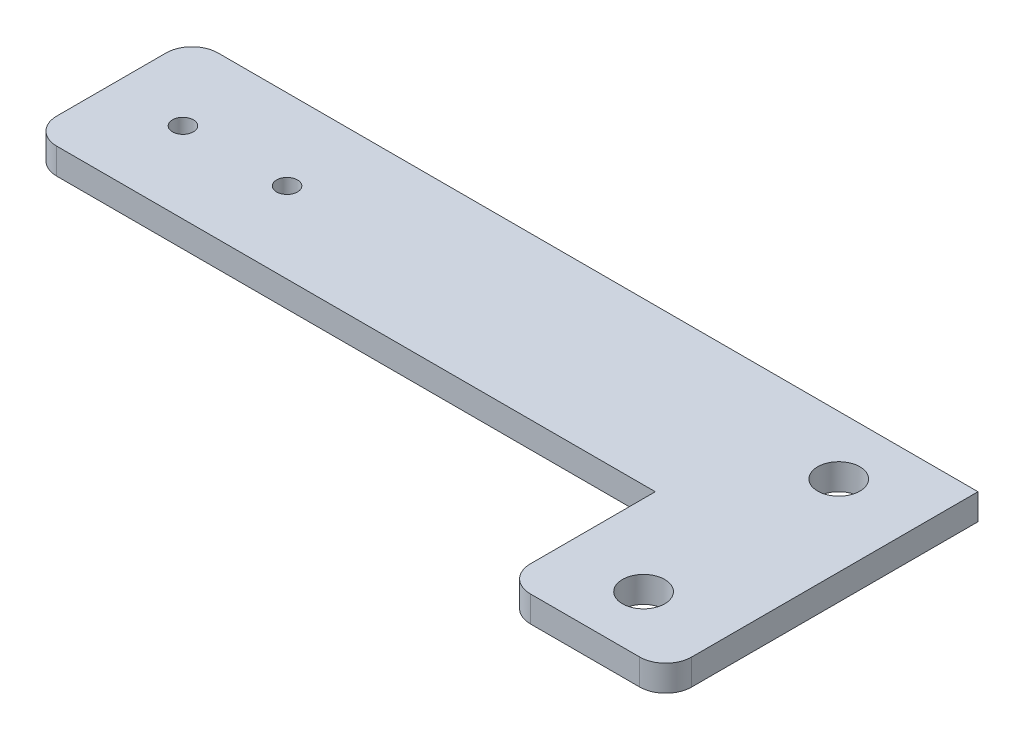
ISO-10303-21;
HEADER;
FILE_DESCRIPTION(('STEP AP214'),'2;1');
FILE_NAME('part.step','',(''),(''),'','','');
FILE_SCHEMA(('AUTOMOTIVE_DESIGN { 1 0 10303 214 1 1 1 1 }'));
ENDSEC;
DATA;
#1=APPLICATION_CONTEXT('core data for automotive mechanical design processes');
#2=APPLICATION_PROTOCOL_DEFINITION('international standard','automotive_design',2000,#1);
#3=PRODUCT_CONTEXT('',#1,'mechanical');
#4=PRODUCT('Part','Part','',(#3));
#5=PRODUCT_RELATED_PRODUCT_CATEGORY('part','',(#4));
#6=PRODUCT_DEFINITION_FORMATION('','',#4);
#7=PRODUCT_DEFINITION_CONTEXT('part definition',#1,'design');
#8=PRODUCT_DEFINITION('design','',#6,#7);
#9=PRODUCT_DEFINITION_SHAPE('','',#8);
#10=(LENGTH_UNIT() NAMED_UNIT(*) SI_UNIT(.MILLI.,.METRE.));
#11=(NAMED_UNIT(*) PLANE_ANGLE_UNIT() SI_UNIT($,.RADIAN.));
#12=(NAMED_UNIT(*) SI_UNIT($,.STERADIAN.) SOLID_ANGLE_UNIT());
#13=UNCERTAINTY_MEASURE_WITH_UNIT(LENGTH_MEASURE(1.E-05),#10,'distance_accuracy_value','');
#14=(GEOMETRIC_REPRESENTATION_CONTEXT(3) GLOBAL_UNCERTAINTY_ASSIGNED_CONTEXT((#13)) GLOBAL_UNIT_ASSIGNED_CONTEXT((#10,
#11,#12)) REPRESENTATION_CONTEXT('',''));
#15=CARTESIAN_POINT('',(0.,0.,0.));
#16=DIRECTION('',(0.,0.,1.));
#17=DIRECTION('',(1.,0.,0.));
#18=AXIS2_PLACEMENT_3D('',#15,#16,#17);
#19=CARTESIAN_POINT('',(0.,6.35,39.37));
#20=DIRECTION('',(1.,0.,0.));
#21=DIRECTION('',(0.,0.,-1.));
#22=AXIS2_PLACEMENT_3D('',#19,#20,#21);
#23=PLANE('',#22);
#24=DIRECTION('',(0.,0.,1.));
#25=VECTOR('',#24,1.);
#26=CARTESIAN_POINT('',(0.,0.,39.37));
#27=LINE('',#26,#25);
#28=CARTESIAN_POINT('',(0.,0.,6.35));
#29=VERTEX_POINT('',#28);
#30=CARTESIAN_POINT('',(0.,0.,33.02));
#31=VERTEX_POINT('',#30);
#32=EDGE_CURVE('E148',#29,#31,#27,.T.);
#33=ORIENTED_EDGE('',*,*,#32,.T.);
#34=DIRECTION('',(0.,-1.,0.));
#35=VECTOR('',#34,1.);
#36=CARTESIAN_POINT('',(0.,6.35,33.02));
#37=LINE('',#36,#35);
#38=CARTESIAN_POINT('',(0.,6.35,33.02));
#39=VERTEX_POINT('',#38);
#40=EDGE_CURVE('E45',#31,#39,#37,.F.);
#41=ORIENTED_EDGE('',*,*,#40,.T.);
#42=DIRECTION('',(0.,0.,1.));
#43=VECTOR('',#42,1.);
#44=CARTESIAN_POINT('',(0.,6.35,39.37));
#45=LINE('',#44,#43);
#46=CARTESIAN_POINT('',(0.,6.35,6.35));
#47=VERTEX_POINT('',#46);
#48=EDGE_CURVE('E127',#47,#39,#45,.T.);
#49=ORIENTED_EDGE('',*,*,#48,.F.);
#50=DIRECTION('',(0.,-1.,0.));
#51=VECTOR('',#50,1.);
#52=CARTESIAN_POINT('',(0.,6.35,6.35));
#53=LINE('',#52,#51);
#54=EDGE_CURVE('E189',#47,#29,#53,.T.);
#55=ORIENTED_EDGE('',*,*,#54,.T.);
#56=EDGE_LOOP('',(#33,#41,#49,#55));
#57=FACE_BOUND('',#56,.T.);
#58=ADVANCED_FACE('F37',(#57),#23,.F.);
#59=CARTESIAN_POINT('',(152.4,6.35,39.37));
#60=DIRECTION('',(0.,0.,-1.));
#61=DIRECTION('',(-1.,0.,0.));
#62=AXIS2_PLACEMENT_3D('',#59,#60,#61);
#63=PLANE('',#62);
#64=DIRECTION('',(1.,0.,0.));
#65=VECTOR('',#64,1.);
#66=CARTESIAN_POINT('',(152.4,6.35,39.37));
#67=LINE('',#66,#65);
#68=CARTESIAN_POINT('',(6.35000000000005,6.35,39.37));
#69=VERTEX_POINT('',#68);
#70=CARTESIAN_POINT('',(152.4,6.35,39.37));
#71=VERTEX_POINT('',#70);
#72=EDGE_CURVE('E115',#69,#71,#67,.T.);
#73=ORIENTED_EDGE('',*,*,#72,.F.);
#74=DIRECTION('',(0.,-1.,0.));
#75=VECTOR('',#74,1.);
#76=CARTESIAN_POINT('',(6.34999999999999,6.35,39.37));
#77=LINE('',#76,#75);
#78=CARTESIAN_POINT('',(6.35000000000005,0.,39.37));
#79=VERTEX_POINT('',#78);
#80=EDGE_CURVE('E187',#69,#79,#77,.T.);
#81=ORIENTED_EDGE('',*,*,#80,.T.);
#82=DIRECTION('',(1.,0.,0.));
#83=VECTOR('',#82,1.);
#84=CARTESIAN_POINT('',(152.4,0.,39.37));
#85=LINE('',#84,#83);
#86=CARTESIAN_POINT('',(152.4,0.,39.37));
#87=VERTEX_POINT('',#86);
#88=EDGE_CURVE('E133',#79,#87,#85,.T.);
#89=ORIENTED_EDGE('',*,*,#88,.T.);
#90=DIRECTION('',(0.,-1.,0.));
#91=VECTOR('',#90,1.);
#92=CARTESIAN_POINT('',(152.4,6.35,39.37));
#93=LINE('',#92,#91);
#94=EDGE_CURVE('E130',#71,#87,#93,.T.);
#95=ORIENTED_EDGE('',*,*,#94,.F.);
#96=EDGE_LOOP('',(#73,#81,#89,#95));
#97=FACE_BOUND('',#96,.T.);
#98=ADVANCED_FACE('F131',(#97),#63,.F.);
#99=CARTESIAN_POINT('',(152.4,6.35,76.2));
#100=DIRECTION('',(1.,0.,0.));
#101=DIRECTION('',(0.,0.,-1.));
#102=AXIS2_PLACEMENT_3D('',#99,#100,#101);
#103=PLANE('',#102);
#104=DIRECTION('',(0.,0.,1.));
#105=VECTOR('',#104,1.);
#106=CARTESIAN_POINT('',(152.4,0.,76.2));
#107=LINE('',#106,#105);
#108=CARTESIAN_POINT('',(152.4,0.,69.85));
#109=VERTEX_POINT('',#108);
#110=EDGE_CURVE('E153',#87,#109,#107,.T.);
#111=ORIENTED_EDGE('',*,*,#110,.T.);
#112=DIRECTION('',(0.,-1.,0.));
#113=VECTOR('',#112,1.);
#114=CARTESIAN_POINT('',(152.4,6.35,69.85));
#115=LINE('',#114,#113);
#116=CARTESIAN_POINT('',(152.4,6.35,69.85));
#117=VERTEX_POINT('',#116);
#118=EDGE_CURVE('E58',#109,#117,#115,.F.);
#119=ORIENTED_EDGE('',*,*,#118,.T.);
#120=DIRECTION('',(0.,0.,1.));
#121=VECTOR('',#120,1.);
#122=CARTESIAN_POINT('',(152.4,6.35,76.2));
#123=LINE('',#122,#121);
#124=EDGE_CURVE('E119',#71,#117,#123,.T.);
#125=ORIENTED_EDGE('',*,*,#124,.F.);
#126=ORIENTED_EDGE('',*,*,#94,.T.);
#127=EDGE_LOOP('',(#111,#119,#125,#126));
#128=FACE_BOUND('',#127,.T.);
#129=ADVANCED_FACE('F138',(#128),#103,.F.);
#130=CARTESIAN_POINT('',(191.77,6.35,76.2));
#131=DIRECTION('',(0.,0.,-1.));
#132=DIRECTION('',(-1.,0.,0.));
#133=AXIS2_PLACEMENT_3D('',#130,#131,#132);
#134=PLANE('',#133);
#135=DIRECTION('',(1.,0.,0.));
#136=VECTOR('',#135,1.);
#137=CARTESIAN_POINT('',(191.77,0.,76.2));
#138=LINE('',#137,#136);
#139=CARTESIAN_POINT('',(158.75,0.,76.2));
#140=VERTEX_POINT('',#139);
#141=CARTESIAN_POINT('',(185.42,0.,76.2));
#142=VERTEX_POINT('',#141);
#143=EDGE_CURVE('E155',#140,#142,#138,.T.);
#144=ORIENTED_EDGE('',*,*,#143,.T.);
#145=DIRECTION('',(0.,-1.,0.));
#146=VECTOR('',#145,1.);
#147=CARTESIAN_POINT('',(185.42,6.35,76.2));
#148=LINE('',#147,#146);
#149=CARTESIAN_POINT('',(185.42,6.35,76.2));
#150=VERTEX_POINT('',#149);
#151=EDGE_CURVE('E177',#142,#150,#148,.F.);
#152=ORIENTED_EDGE('',*,*,#151,.T.);
#153=DIRECTION('',(1.,0.,0.));
#154=VECTOR('',#153,1.);
#155=CARTESIAN_POINT('',(191.77,6.35,76.2));
#156=LINE('',#155,#154);
#157=CARTESIAN_POINT('',(158.75,6.35,76.2));
#158=VERTEX_POINT('',#157);
#159=EDGE_CURVE('E139',#158,#150,#156,.T.);
#160=ORIENTED_EDGE('',*,*,#159,.F.);
#161=DIRECTION('',(0.,-1.,0.));
#162=VECTOR('',#161,1.);
#163=CARTESIAN_POINT('',(158.75,6.35,76.2));
#164=LINE('',#163,#162);
#165=EDGE_CURVE('E174',#158,#140,#164,.T.);
#166=ORIENTED_EDGE('',*,*,#165,.T.);
#167=EDGE_LOOP('',(#144,#152,#160,#166));
#168=FACE_BOUND('',#167,.T.);
#169=ADVANCED_FACE('F209',(#168),#134,.F.);
#170=CARTESIAN_POINT('',(191.77,6.35,0.));
#171=DIRECTION('',(-1.,0.,0.));
#172=DIRECTION('',(0.,0.,1.));
#173=AXIS2_PLACEMENT_3D('',#170,#171,#172);
#174=PLANE('',#173);
#175=DIRECTION('',(0.,0.,-1.));
#176=VECTOR('',#175,1.);
#177=CARTESIAN_POINT('',(191.77,6.35,0.));
#178=LINE('',#177,#176);
#179=CARTESIAN_POINT('',(191.77,6.35,69.85));
#180=VERTEX_POINT('',#179);
#181=CARTESIAN_POINT('',(191.77,6.35,0.));
#182=VERTEX_POINT('',#181);
#183=EDGE_CURVE('E141',#180,#182,#178,.T.);
#184=ORIENTED_EDGE('',*,*,#183,.F.);
#185=DIRECTION('',(0.,-1.,0.));
#186=VECTOR('',#185,1.);
#187=CARTESIAN_POINT('',(191.77,6.35,69.85));
#188=LINE('',#187,#186);
#189=CARTESIAN_POINT('',(191.77,0.,69.85));
#190=VERTEX_POINT('',#189);
#191=EDGE_CURVE('E135',#180,#190,#188,.T.);
#192=ORIENTED_EDGE('',*,*,#191,.T.);
#193=DIRECTION('',(0.,0.,-1.));
#194=VECTOR('',#193,1.);
#195=CARTESIAN_POINT('',(191.77,0.,0.));
#196=LINE('',#195,#194);
#197=CARTESIAN_POINT('',(191.77,0.,0.));
#198=VERTEX_POINT('',#197);
#199=EDGE_CURVE('E158',#190,#198,#196,.T.);
#200=ORIENTED_EDGE('',*,*,#199,.T.);
#201=DIRECTION('',(0.,-1.,0.));
#202=VECTOR('',#201,1.);
#203=CARTESIAN_POINT('',(191.77,6.35,0.));
#204=LINE('',#203,#202);
#205=EDGE_CURVE('E136',#182,#198,#204,.T.);
#206=ORIENTED_EDGE('',*,*,#205,.F.);
#207=EDGE_LOOP('',(#184,#192,#200,#206));
#208=FACE_BOUND('',#207,.T.);
#209=ADVANCED_FACE('F217',(#208),#174,.F.);
#210=CARTESIAN_POINT('',(0.,6.35,0.));
#211=DIRECTION('',(0.,0.,1.));
#212=DIRECTION('',(1.,0.,0.));
#213=AXIS2_PLACEMENT_3D('',#210,#211,#212);
#214=PLANE('',#213);
#215=DIRECTION('',(-1.,0.,0.));
#216=VECTOR('',#215,1.);
#217=CARTESIAN_POINT('',(0.,0.,0.));
#218=LINE('',#217,#216);
#219=CARTESIAN_POINT('',(6.35,0.,0.));
#220=VERTEX_POINT('',#219);
#221=EDGE_CURVE('E160',#198,#220,#218,.T.);
#222=ORIENTED_EDGE('',*,*,#221,.T.);
#223=DIRECTION('',(0.,-1.,0.));
#224=VECTOR('',#223,1.);
#225=CARTESIAN_POINT('',(6.35,6.35,0.));
#226=LINE('',#225,#224);
#227=CARTESIAN_POINT('',(6.35,6.35,0.));
#228=VERTEX_POINT('',#227);
#229=EDGE_CURVE('E11',#220,#228,#226,.F.);
#230=ORIENTED_EDGE('',*,*,#229,.T.);
#231=DIRECTION('',(-1.,0.,0.));
#232=VECTOR('',#231,1.);
#233=CARTESIAN_POINT('',(0.,6.35,0.));
#234=LINE('',#233,#232);
#235=EDGE_CURVE('E146',#182,#228,#234,.T.);
#236=ORIENTED_EDGE('',*,*,#235,.F.);
#237=ORIENTED_EDGE('',*,*,#205,.T.);
#238=EDGE_LOOP('',(#222,#230,#236,#237));
#239=FACE_BOUND('',#238,.T.);
#240=ADVANCED_FACE('F219',(#239),#214,.F.);
#241=CARTESIAN_POINT('',(0.,6.35,0.));
#242=DIRECTION('',(0.,-1.,0.));
#243=DIRECTION('',(0.,0.,-1.));
#244=AXIS2_PLACEMENT_3D('',#241,#242,#243);
#245=PLANE('',#244);
#246=CARTESIAN_POINT('',(17.4625,6.35,19.685));
#247=DIRECTION('',(0.,1.,0.));
#248=DIRECTION('',(0.,0.,1.));
#249=AXIS2_PLACEMENT_3D('',#246,#247,#248);
#250=CIRCLE('',#249,2.5527);
#251=CARTESIAN_POINT('',(17.4625,6.35,22.2377));
#252=VERTEX_POINT('',#251);
#253=EDGE_CURVE('E151',#252,#252,#250,.T.);
#254=ORIENTED_EDGE('',*,*,#253,.F.);
#255=EDGE_LOOP('',(#254));
#256=FACE_BOUND('',#255,.T.);
#257=CARTESIAN_POINT('',(42.8625,6.35,19.685));
#258=DIRECTION('',(0.,1.,0.));
#259=DIRECTION('',(0.,0.,1.));
#260=AXIS2_PLACEMENT_3D('',#257,#258,#259);
#261=CIRCLE('',#260,2.55270000000001);
#262=CARTESIAN_POINT('',(42.8625,6.35,22.2377));
#263=VERTEX_POINT('',#262);
#264=EDGE_CURVE('E363',#263,#263,#261,.T.);
#265=ORIENTED_EDGE('',*,*,#264,.F.);
#266=EDGE_LOOP('',(#265));
#267=FACE_BOUND('',#266,.T.);
#268=CARTESIAN_POINT('',(172.085,6.35,14.2875));
#269=DIRECTION('',(0.,1.,0.));
#270=DIRECTION('',(0.,0.,1.));
#271=AXIS2_PLACEMENT_3D('',#268,#269,#270);
#272=CIRCLE('',#271,5.1562);
#273=CARTESIAN_POINT('',(172.085,6.35,19.4437));
#274=VERTEX_POINT('',#273);
#275=EDGE_CURVE('E367',#274,#274,#272,.T.);
#276=ORIENTED_EDGE('',*,*,#275,.F.);
#277=EDGE_LOOP('',(#276));
#278=FACE_BOUND('',#277,.T.);
#279=CARTESIAN_POINT('',(172.085,6.35,61.9125));
#280=DIRECTION('',(0.,1.,0.));
#281=DIRECTION('',(0.,0.,1.));
#282=AXIS2_PLACEMENT_3D('',#279,#280,#281);
#283=CIRCLE('',#282,5.1562);
#284=CARTESIAN_POINT('',(172.085,6.35,67.0687));
#285=VERTEX_POINT('',#284);
#286=EDGE_CURVE('E370',#285,#285,#283,.T.);
#287=ORIENTED_EDGE('',*,*,#286,.F.);
#288=EDGE_LOOP('',(#287));
#289=FACE_BOUND('',#288,.T.);
#290=ORIENTED_EDGE('',*,*,#159,.T.);
#291=CARTESIAN_POINT('',(185.42,6.35,69.85));
#292=DIRECTION('',(0.,-1.,0.));
#293=DIRECTION('',(0.,0.,-1.));
#294=AXIS2_PLACEMENT_3D('',#291,#292,#293);
#295=CIRCLE('',#294,6.35);
#296=EDGE_CURVE('E184',#150,#180,#295,.F.);
#297=ORIENTED_EDGE('',*,*,#296,.T.);
#298=ORIENTED_EDGE('',*,*,#183,.T.);
#299=ORIENTED_EDGE('',*,*,#235,.T.);
#300=CARTESIAN_POINT('',(6.35,6.35,6.35));
#301=DIRECTION('',(0.,-1.,0.));
#302=DIRECTION('',(0.,0.,-1.));
#303=AXIS2_PLACEMENT_3D('',#300,#301,#302);
#304=CIRCLE('',#303,6.35);
#305=EDGE_CURVE('E179',#228,#47,#304,.F.);
#306=ORIENTED_EDGE('',*,*,#305,.T.);
#307=ORIENTED_EDGE('',*,*,#48,.T.);
#308=CARTESIAN_POINT('',(6.34999999999999,6.35,33.02));
#309=DIRECTION('',(0.,-1.,0.));
#310=DIRECTION('',(0.,0.,-1.));
#311=AXIS2_PLACEMENT_3D('',#308,#309,#310);
#312=CIRCLE('',#311,6.35);
#313=EDGE_CURVE('E123',#39,#69,#312,.F.);
#314=ORIENTED_EDGE('',*,*,#313,.T.);
#315=ORIENTED_EDGE('',*,*,#72,.T.);
#316=ORIENTED_EDGE('',*,*,#124,.T.);
#317=CARTESIAN_POINT('',(158.75,6.35,69.85));
#318=DIRECTION('',(0.,-1.,0.));
#319=DIRECTION('',(0.,0.,-1.));
#320=AXIS2_PLACEMENT_3D('',#317,#318,#319);
#321=CIRCLE('',#320,6.35);
#322=EDGE_CURVE('E182',#117,#158,#321,.F.);
#323=ORIENTED_EDGE('',*,*,#322,.T.);
#324=EDGE_LOOP('',(#290,#297,#298,#299,#306,#307,#314,#315,#316,#323));
#325=FACE_BOUND('',#324,.T.);
#326=ADVANCED_FACE('F118',(#256,#267,#278,#289,#325),#245,.F.);
#327=CARTESIAN_POINT('',(0.,0.,0.));
#328=DIRECTION('',(0.,-1.,0.));
#329=DIRECTION('',(0.,0.,-1.));
#330=AXIS2_PLACEMENT_3D('',#327,#328,#329);
#331=PLANE('',#330);
#332=CARTESIAN_POINT('',(17.4625,0.,19.685));
#333=DIRECTION('',(0.,-1.,0.));
#334=DIRECTION('',(0.,0.,-1.));
#335=AXIS2_PLACEMENT_3D('',#332,#333,#334);
#336=CIRCLE('',#335,2.5527);
#337=CARTESIAN_POINT('',(17.4625,0.,17.1323));
#338=VERTEX_POINT('',#337);
#339=EDGE_CURVE('E385',#338,#338,#336,.F.);
#340=ORIENTED_EDGE('',*,*,#339,.T.);
#341=EDGE_LOOP('',(#340));
#342=FACE_BOUND('',#341,.T.);
#343=CARTESIAN_POINT('',(42.8625,0.,19.685));
#344=DIRECTION('',(0.,-1.,0.));
#345=DIRECTION('',(0.,0.,-1.));
#346=AXIS2_PLACEMENT_3D('',#343,#344,#345);
#347=CIRCLE('',#346,2.55270000000001);
#348=CARTESIAN_POINT('',(42.8625,0.,17.1323));
#349=VERTEX_POINT('',#348);
#350=EDGE_CURVE('E381',#349,#349,#347,.F.);
#351=ORIENTED_EDGE('',*,*,#350,.T.);
#352=EDGE_LOOP('',(#351));
#353=FACE_BOUND('',#352,.T.);
#354=CARTESIAN_POINT('',(172.085,0.,14.2875));
#355=DIRECTION('',(0.,-1.,0.));
#356=DIRECTION('',(0.,0.,-1.));
#357=AXIS2_PLACEMENT_3D('',#354,#355,#356);
#358=CIRCLE('',#357,5.1562);
#359=CARTESIAN_POINT('',(172.085,0.,9.1313));
#360=VERTEX_POINT('',#359);
#361=EDGE_CURVE('E372',#360,#360,#358,.F.);
#362=ORIENTED_EDGE('',*,*,#361,.T.);
#363=EDGE_LOOP('',(#362));
#364=FACE_BOUND('',#363,.T.);
#365=CARTESIAN_POINT('',(172.085,0.,61.9125));
#366=DIRECTION('',(0.,-1.,0.));
#367=DIRECTION('',(0.,0.,-1.));
#368=AXIS2_PLACEMENT_3D('',#365,#366,#367);
#369=CIRCLE('',#368,5.1562);
#370=CARTESIAN_POINT('',(172.085,0.,56.7563));
#371=VERTEX_POINT('',#370);
#372=EDGE_CURVE('E373',#371,#371,#369,.F.);
#373=ORIENTED_EDGE('',*,*,#372,.T.);
#374=EDGE_LOOP('',(#373));
#375=FACE_BOUND('',#374,.T.);
#376=ORIENTED_EDGE('',*,*,#199,.F.);
#377=CARTESIAN_POINT('',(185.42,0.,69.85));
#378=DIRECTION('',(0.,-1.,0.));
#379=DIRECTION('',(0.,0.,-1.));
#380=AXIS2_PLACEMENT_3D('',#377,#378,#379);
#381=CIRCLE('',#380,6.35);
#382=EDGE_CURVE('E172',#190,#142,#381,.T.);
#383=ORIENTED_EDGE('',*,*,#382,.T.);
#384=ORIENTED_EDGE('',*,*,#143,.F.);
#385=CARTESIAN_POINT('',(158.75,0.,69.85));
#386=DIRECTION('',(0.,-1.,0.));
#387=DIRECTION('',(0.,0.,-1.));
#388=AXIS2_PLACEMENT_3D('',#385,#386,#387);
#389=CIRCLE('',#388,6.35);
#390=EDGE_CURVE('E170',#140,#109,#389,.T.);
#391=ORIENTED_EDGE('',*,*,#390,.T.);
#392=ORIENTED_EDGE('',*,*,#110,.F.);
#393=ORIENTED_EDGE('',*,*,#88,.F.);
#394=CARTESIAN_POINT('',(6.34999999999999,0.,33.02));
#395=DIRECTION('',(0.,-1.,0.));
#396=DIRECTION('',(0.,0.,-1.));
#397=AXIS2_PLACEMENT_3D('',#394,#395,#396);
#398=CIRCLE('',#397,6.35);
#399=EDGE_CURVE('E168',#79,#31,#398,.T.);
#400=ORIENTED_EDGE('',*,*,#399,.T.);
#401=ORIENTED_EDGE('',*,*,#32,.F.);
#402=CARTESIAN_POINT('',(6.35,0.,6.35));
#403=DIRECTION('',(0.,-1.,0.));
#404=DIRECTION('',(0.,0.,-1.));
#405=AXIS2_PLACEMENT_3D('',#402,#403,#404);
#406=CIRCLE('',#405,6.35);
#407=EDGE_CURVE('E166',#29,#220,#406,.T.);
#408=ORIENTED_EDGE('',*,*,#407,.T.);
#409=ORIENTED_EDGE('',*,*,#221,.F.);
#410=EDGE_LOOP('',(#376,#383,#384,#391,#392,#393,#400,#401,#408,#409));
#411=FACE_BOUND('',#410,.T.);
#412=ADVANCED_FACE('F201',(#342,#353,#364,#375,#411),#331,.T.);
#413=CARTESIAN_POINT('',(172.085,-0.00100000000000013,61.9125));
#414=DIRECTION('',(0.,1.,0.));
#415=DIRECTION('',(0.,0.,1.));
#416=AXIS2_PLACEMENT_3D('',#413,#414,#415);
#417=CYLINDRICAL_SURFACE('',#416,5.1562);
#418=ORIENTED_EDGE('',*,*,#372,.F.);
#419=EDGE_LOOP('',(#418));
#420=FACE_BOUND('',#419,.T.);
#421=ORIENTED_EDGE('',*,*,#286,.T.);
#422=EDGE_LOOP('',(#421));
#423=FACE_BOUND('',#422,.T.);
#424=ADVANCED_FACE('F284',(#420,#423),#417,.F.);
#425=CARTESIAN_POINT('',(172.085,-0.00100000000000013,14.2875));
#426=DIRECTION('',(0.,1.,0.));
#427=DIRECTION('',(0.,0.,1.));
#428=AXIS2_PLACEMENT_3D('',#425,#426,#427);
#429=CYLINDRICAL_SURFACE('',#428,5.1562);
#430=ORIENTED_EDGE('',*,*,#361,.F.);
#431=EDGE_LOOP('',(#430));
#432=FACE_BOUND('',#431,.T.);
#433=ORIENTED_EDGE('',*,*,#275,.T.);
#434=EDGE_LOOP('',(#433));
#435=FACE_BOUND('',#434,.T.);
#436=ADVANCED_FACE('F275',(#432,#435),#429,.F.);
#437=CARTESIAN_POINT('',(42.8625,-0.00100000000000013,19.685));
#438=DIRECTION('',(0.,1.,0.));
#439=DIRECTION('',(0.,0.,1.));
#440=AXIS2_PLACEMENT_3D('',#437,#438,#439);
#441=CYLINDRICAL_SURFACE('',#440,2.55270000000001);
#442=ORIENTED_EDGE('',*,*,#350,.F.);
#443=EDGE_LOOP('',(#442));
#444=FACE_BOUND('',#443,.T.);
#445=ORIENTED_EDGE('',*,*,#264,.T.);
#446=EDGE_LOOP('',(#445));
#447=FACE_BOUND('',#446,.T.);
#448=ADVANCED_FACE('F266',(#444,#447),#441,.F.);
#449=CARTESIAN_POINT('',(17.4625,-0.00100000000000013,19.685));
#450=DIRECTION('',(0.,1.,0.));
#451=DIRECTION('',(0.,0.,1.));
#452=AXIS2_PLACEMENT_3D('',#449,#450,#451);
#453=CYLINDRICAL_SURFACE('',#452,2.5527);
#454=ORIENTED_EDGE('',*,*,#339,.F.);
#455=EDGE_LOOP('',(#454));
#456=FACE_BOUND('',#455,.T.);
#457=ORIENTED_EDGE('',*,*,#253,.T.);
#458=EDGE_LOOP('',(#457));
#459=FACE_BOUND('',#458,.T.);
#460=ADVANCED_FACE('F235',(#456,#459),#453,.F.);
#461=CARTESIAN_POINT('',(185.42,6.35,69.85));
#462=DIRECTION('',(0.,-1.,0.));
#463=DIRECTION('',(0.,0.,-1.));
#464=AXIS2_PLACEMENT_3D('',#461,#462,#463);
#465=CYLINDRICAL_SURFACE('',#464,6.35);
#466=ORIENTED_EDGE('',*,*,#296,.F.);
#467=ORIENTED_EDGE('',*,*,#151,.F.);
#468=ORIENTED_EDGE('',*,*,#382,.F.);
#469=ORIENTED_EDGE('',*,*,#191,.F.);
#470=EDGE_LOOP('',(#466,#467,#468,#469));
#471=FACE_BOUND('',#470,.T.);
#472=ADVANCED_FACE('F212',(#471),#465,.T.);
#473=CARTESIAN_POINT('',(158.75,6.35,69.85));
#474=DIRECTION('',(0.,-1.,0.));
#475=DIRECTION('',(0.,0.,-1.));
#476=AXIS2_PLACEMENT_3D('',#473,#474,#475);
#477=CYLINDRICAL_SURFACE('',#476,6.35);
#478=ORIENTED_EDGE('',*,*,#322,.F.);
#479=ORIENTED_EDGE('',*,*,#118,.F.);
#480=ORIENTED_EDGE('',*,*,#390,.F.);
#481=ORIENTED_EDGE('',*,*,#165,.F.);
#482=EDGE_LOOP('',(#478,#479,#480,#481));
#483=FACE_BOUND('',#482,.T.);
#484=ADVANCED_FACE('F204',(#483),#477,.T.);
#485=CARTESIAN_POINT('',(6.34999999999999,6.35,33.02));
#486=DIRECTION('',(0.,-1.,0.));
#487=DIRECTION('',(0.,0.,-1.));
#488=AXIS2_PLACEMENT_3D('',#485,#486,#487);
#489=CYLINDRICAL_SURFACE('',#488,6.35);
#490=ORIENTED_EDGE('',*,*,#313,.F.);
#491=ORIENTED_EDGE('',*,*,#40,.F.);
#492=ORIENTED_EDGE('',*,*,#399,.F.);
#493=ORIENTED_EDGE('',*,*,#80,.F.);
#494=EDGE_LOOP('',(#490,#491,#492,#493));
#495=FACE_BOUND('',#494,.T.);
#496=ADVANCED_FACE('F198',(#495),#489,.T.);
#497=CARTESIAN_POINT('',(6.35,6.35,6.35));
#498=DIRECTION('',(0.,-1.,0.));
#499=DIRECTION('',(0.,0.,-1.));
#500=AXIS2_PLACEMENT_3D('',#497,#498,#499);
#501=CYLINDRICAL_SURFACE('',#500,6.35);
#502=ORIENTED_EDGE('',*,*,#305,.F.);
#503=ORIENTED_EDGE('',*,*,#229,.F.);
#504=ORIENTED_EDGE('',*,*,#407,.F.);
#505=ORIENTED_EDGE('',*,*,#54,.F.);
#506=EDGE_LOOP('',(#502,#503,#504,#505));
#507=FACE_BOUND('',#506,.T.);
#508=ADVANCED_FACE('F39',(#507),#501,.T.);
#509=CLOSED_SHELL('',(#58,#98,#129,#169,#209,#240,#326,#412,#424,#436,#448,#460,#472,#484,#496,#508));
#510=MANIFOLD_SOLID_BREP('B2',#509);
#511=ADVANCED_BREP_SHAPE_REPRESENTATION('',(#18,#510),#14);
#512=SHAPE_DEFINITION_REPRESENTATION(#9,#511);
ENDSEC;
END-ISO-10303-21;
